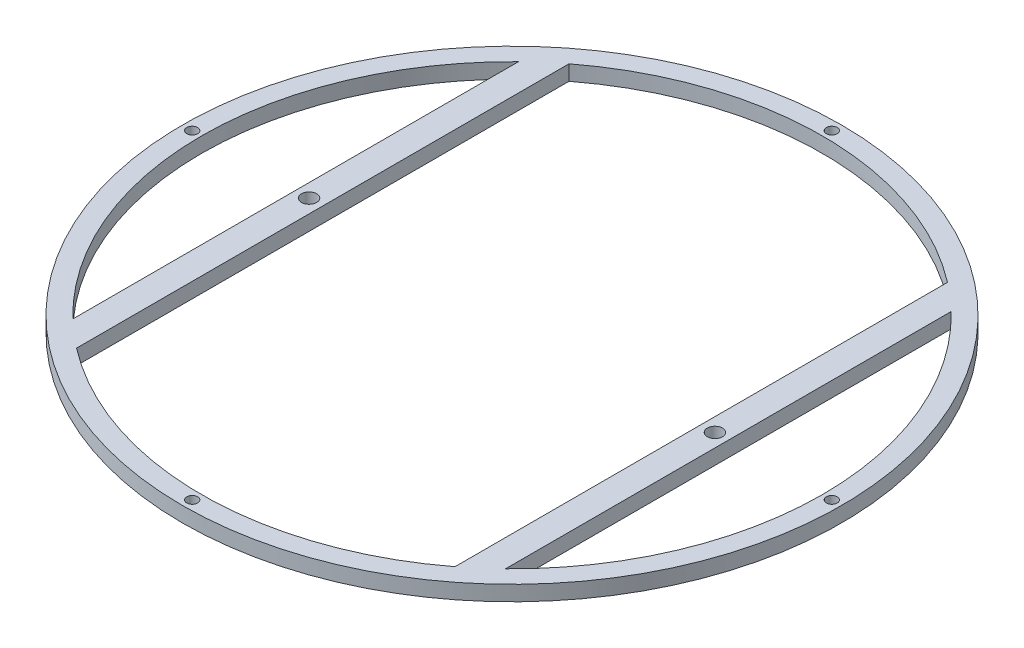
ISO-10303-21;
HEADER;
FILE_DESCRIPTION(('STEP AP214'),'2;1');
FILE_NAME('part.step','',(''),(''),'','','');
FILE_SCHEMA(('AUTOMOTIVE_DESIGN { 1 0 10303 214 1 1 1 1 }'));
ENDSEC;
DATA;
#1=APPLICATION_CONTEXT('core data for automotive mechanical design processes');
#2=APPLICATION_PROTOCOL_DEFINITION('international standard','automotive_design',2000,#1);
#3=PRODUCT_CONTEXT('',#1,'mechanical');
#4=PRODUCT('Part','Part','',(#3));
#5=PRODUCT_RELATED_PRODUCT_CATEGORY('part','',(#4));
#6=PRODUCT_DEFINITION_FORMATION('','',#4);
#7=PRODUCT_DEFINITION_CONTEXT('part definition',#1,'design');
#8=PRODUCT_DEFINITION('design','',#6,#7);
#9=PRODUCT_DEFINITION_SHAPE('','',#8);
#10=(LENGTH_UNIT() NAMED_UNIT(*) SI_UNIT(.MILLI.,.METRE.));
#11=(NAMED_UNIT(*) PLANE_ANGLE_UNIT() SI_UNIT($,.RADIAN.));
#12=(NAMED_UNIT(*) SI_UNIT($,.STERADIAN.) SOLID_ANGLE_UNIT());
#13=UNCERTAINTY_MEASURE_WITH_UNIT(LENGTH_MEASURE(1.E-05),#10,'distance_accuracy_value','');
#14=(GEOMETRIC_REPRESENTATION_CONTEXT(3) GLOBAL_UNCERTAINTY_ASSIGNED_CONTEXT((#13)) GLOBAL_UNIT_ASSIGNED_CONTEXT((#10,
#11,#12)) REPRESENTATION_CONTEXT('',''));
#15=CARTESIAN_POINT('',(0.,0.,0.));
#16=DIRECTION('',(0.,0.,1.));
#17=DIRECTION('',(1.,0.,0.));
#18=AXIS2_PLACEMENT_3D('',#15,#16,#17);
#19=CARTESIAN_POINT('',(0.,3.5,0.));
#20=DIRECTION('',(0.,-1.,0.));
#21=DIRECTION('',(0.,0.,-1.));
#22=AXIS2_PLACEMENT_3D('',#19,#20,#21);
#23=CYLINDRICAL_SURFACE('',#22,76.);
#24=CARTESIAN_POINT('',(0.,3.5,0.));
#25=DIRECTION('',(0.,1.,0.));
#26=DIRECTION('',(0.,0.,1.));
#27=AXIS2_PLACEMENT_3D('',#24,#25,#26);
#28=CIRCLE('',#27,76.);
#29=CARTESIAN_POINT('',(0.,3.5,76.));
#30=VERTEX_POINT('',#29);
#31=EDGE_CURVE('E11',#30,#30,#28,.T.);
#32=ORIENTED_EDGE('',*,*,#31,.F.);
#33=EDGE_LOOP('',(#32));
#34=FACE_BOUND('',#33,.T.);
#35=CARTESIAN_POINT('',(0.,0.,0.));
#36=DIRECTION('',(0.,1.,0.));
#37=DIRECTION('',(0.,0.,1.));
#38=AXIS2_PLACEMENT_3D('',#35,#36,#37);
#39=CIRCLE('',#38,76.);
#40=CARTESIAN_POINT('',(0.,0.,76.));
#41=VERTEX_POINT('',#40);
#42=EDGE_CURVE('E46',#41,#41,#39,.T.);
#43=ORIENTED_EDGE('',*,*,#42,.T.);
#44=EDGE_LOOP('',(#43));
#45=FACE_BOUND('',#44,.T.);
#46=ADVANCED_FACE('F43',(#34,#45),#23,.T.);
#47=CARTESIAN_POINT('',(0.,3.5,0.));
#48=DIRECTION('',(0.,1.,0.));
#49=DIRECTION('',(0.,0.,1.));
#50=AXIS2_PLACEMENT_3D('',#47,#48,#49);
#51=PLANE('',#50);
#52=CARTESIAN_POINT('',(0.,3.5,73.75));
#53=DIRECTION('',(0.,1.,0.));
#54=DIRECTION('',(0.,0.,1.));
#55=AXIS2_PLACEMENT_3D('',#52,#53,#54);
#56=CIRCLE('',#55,1.25);
#57=CARTESIAN_POINT('',(0.,3.5,75.));
#58=VERTEX_POINT('',#57);
#59=EDGE_CURVE('E291',#58,#58,#56,.T.);
#60=ORIENTED_EDGE('',*,*,#59,.F.);
#61=EDGE_LOOP('',(#60));
#62=FACE_BOUND('',#61,.T.);
#63=CARTESIAN_POINT('',(-73.75,3.5,0.));
#64=DIRECTION('',(0.,1.,0.));
#65=DIRECTION('',(0.,0.,1.));
#66=AXIS2_PLACEMENT_3D('',#63,#64,#65);
#67=CIRCLE('',#66,1.25);
#68=CARTESIAN_POINT('',(-73.75,3.5,1.25));
#69=VERTEX_POINT('',#68);
#70=EDGE_CURVE('E288',#69,#69,#67,.T.);
#71=ORIENTED_EDGE('',*,*,#70,.F.);
#72=EDGE_LOOP('',(#71));
#73=FACE_BOUND('',#72,.T.);
#74=CARTESIAN_POINT('',(73.75,3.5,0.));
#75=DIRECTION('',(0.,1.,0.));
#76=DIRECTION('',(0.,0.,-1.));
#77=AXIS2_PLACEMENT_3D('',#74,#75,#76);
#78=CIRCLE('',#77,1.25);
#79=CARTESIAN_POINT('',(73.75,3.5,-1.25));
#80=VERTEX_POINT('',#79);
#81=EDGE_CURVE('E282',#80,#80,#78,.T.);
#82=ORIENTED_EDGE('',*,*,#81,.F.);
#83=EDGE_LOOP('',(#82));
#84=FACE_BOUND('',#83,.T.);
#85=CARTESIAN_POINT('',(0.,3.5,-73.75));
#86=DIRECTION('',(0.,1.,0.));
#87=DIRECTION('',(0.,0.,-1.));
#88=AXIS2_PLACEMENT_3D('',#85,#86,#87);
#89=CIRCLE('',#88,1.25);
#90=CARTESIAN_POINT('',(0.,3.5,-75.));
#91=VERTEX_POINT('',#90);
#92=EDGE_CURVE('E276',#91,#91,#89,.T.);
#93=ORIENTED_EDGE('',*,*,#92,.F.);
#94=EDGE_LOOP('',(#93));
#95=FACE_BOUND('',#94,.T.);
#96=CARTESIAN_POINT('',(-46.7931691909373,3.5,0.));
#97=DIRECTION('',(0.,1.,0.));
#98=DIRECTION('',(0.,0.,1.));
#99=AXIS2_PLACEMENT_3D('',#96,#97,#98);
#100=CIRCLE('',#99,1.75);
#101=CARTESIAN_POINT('',(-46.7931691909373,3.5,1.75));
#102=VERTEX_POINT('',#101);
#103=EDGE_CURVE('E263',#102,#102,#100,.T.);
#104=ORIENTED_EDGE('',*,*,#103,.F.);
#105=EDGE_LOOP('',(#104));
#106=FACE_BOUND('',#105,.T.);
#107=CARTESIAN_POINT('',(46.7931691909373,3.5,0.));
#108=DIRECTION('',(0.,1.,0.));
#109=DIRECTION('',(0.,0.,-1.));
#110=AXIS2_PLACEMENT_3D('',#107,#108,#109);
#111=CIRCLE('',#110,1.75);
#112=CARTESIAN_POINT('',(46.7931691909373,3.5,-1.75));
#113=VERTEX_POINT('',#112);
#114=EDGE_CURVE('E261',#113,#113,#111,.T.);
#115=ORIENTED_EDGE('',*,*,#114,.F.);
#116=EDGE_LOOP('',(#115));
#117=FACE_BOUND('',#116,.T.);
#118=CARTESIAN_POINT('',(0.,3.5,0.));
#119=DIRECTION('',(0.,1.,0.));
#120=DIRECTION('',(0.,0.,1.));
#121=AXIS2_PLACEMENT_3D('',#118,#119,#120);
#122=CIRCLE('',#121,71.6206359691576);
#123=CARTESIAN_POINT('',(49.8931691909372,3.5,51.382751626505));
#124=VERTEX_POINT('',#123);
#125=CARTESIAN_POINT('',(49.8931691909372,3.5,-51.382751626505));
#126=VERTEX_POINT('',#125);
#127=EDGE_CURVE('E57',#124,#126,#122,.T.);
#128=ORIENTED_EDGE('',*,*,#127,.F.);
#129=DIRECTION('',(0.,0.,1.));
#130=VECTOR('',#129,1.);
#131=CARTESIAN_POINT('',(49.8931691909372,3.5,-51.382751626505));
#132=LINE('',#131,#130);
#133=EDGE_CURVE('E136',#126,#124,#132,.T.);
#134=ORIENTED_EDGE('',*,*,#133,.F.);
#135=EDGE_LOOP('',(#128,#134));
#136=FACE_BOUND('',#135,.T.);
#137=CARTESIAN_POINT('',(0.,3.5,0.));
#138=DIRECTION('',(0.,1.,0.));
#139=DIRECTION('',(0.,0.,1.));
#140=AXIS2_PLACEMENT_3D('',#137,#138,#139);
#141=CIRCLE('',#140,71.6206359691576);
#142=CARTESIAN_POINT('',(-49.8931691909373,3.5,-51.382751626505));
#143=VERTEX_POINT('',#142);
#144=CARTESIAN_POINT('',(-49.8931691909373,3.5,51.382751626505));
#145=VERTEX_POINT('',#144);
#146=EDGE_CURVE('E65',#143,#145,#141,.T.);
#147=ORIENTED_EDGE('',*,*,#146,.F.);
#148=DIRECTION('',(0.,0.,-1.));
#149=VECTOR('',#148,1.);
#150=CARTESIAN_POINT('',(-49.8931691909373,3.5,-51.382751626505));
#151=LINE('',#150,#149);
#152=EDGE_CURVE('E116',#145,#143,#151,.T.);
#153=ORIENTED_EDGE('',*,*,#152,.F.);
#154=EDGE_LOOP('',(#147,#153));
#155=FACE_BOUND('',#154,.T.);
#156=CARTESIAN_POINT('',(0.,3.5,0.));
#157=DIRECTION('',(0.,1.,0.));
#158=DIRECTION('',(0.,0.,1.));
#159=AXIS2_PLACEMENT_3D('',#156,#157,#158);
#160=CIRCLE('',#159,71.6206359691576);
#161=CARTESIAN_POINT('',(-43.6442747378757,3.5,56.7863784655389));
#162=VERTEX_POINT('',#161);
#163=CARTESIAN_POINT('',(43.6442747378757,3.5,56.7863784655389));
#164=VERTEX_POINT('',#163);
#165=EDGE_CURVE('E122',#162,#164,#160,.T.);
#166=ORIENTED_EDGE('',*,*,#165,.F.);
#167=DIRECTION('',(0.,0.,1.));
#168=VECTOR('',#167,1.);
#169=CARTESIAN_POINT('',(-43.6442747378757,3.5,-56.7863784655389));
#170=LINE('',#169,#168);
#171=CARTESIAN_POINT('',(-43.6442747378756,3.5,-56.7863784655389));
#172=VERTEX_POINT('',#171);
#173=EDGE_CURVE('E149',#172,#162,#170,.T.);
#174=ORIENTED_EDGE('',*,*,#173,.F.);
#175=CARTESIAN_POINT('',(0.,3.5,0.));
#176=DIRECTION('',(0.,1.,0.));
#177=DIRECTION('',(0.,0.,1.));
#178=AXIS2_PLACEMENT_3D('',#175,#176,#177);
#179=CIRCLE('',#178,71.6206359691576);
#180=CARTESIAN_POINT('',(43.6442747378757,3.5,-56.7863784655389));
#181=VERTEX_POINT('',#180);
#182=EDGE_CURVE('E161',#181,#172,#179,.T.);
#183=ORIENTED_EDGE('',*,*,#182,.F.);
#184=DIRECTION('',(0.,0.,-1.));
#185=VECTOR('',#184,1.);
#186=CARTESIAN_POINT('',(43.6442747378757,3.5,-56.7863784655389));
#187=LINE('',#186,#185);
#188=EDGE_CURVE('E124',#164,#181,#187,.T.);
#189=ORIENTED_EDGE('',*,*,#188,.F.);
#190=EDGE_LOOP('',(#166,#174,#183,#189));
#191=FACE_BOUND('',#190,.T.);
#192=ORIENTED_EDGE('',*,*,#31,.T.);
#193=EDGE_LOOP('',(#192));
#194=FACE_BOUND('',#193,.T.);
#195=ADVANCED_FACE('F120',(#62,#73,#84,#95,#106,#117,#136,#155,#191,#194),#51,.T.);
#196=CARTESIAN_POINT('',(0.,0.,0.));
#197=DIRECTION('',(0.,1.,0.));
#198=DIRECTION('',(0.,0.,1.));
#199=AXIS2_PLACEMENT_3D('',#196,#197,#198);
#200=PLANE('',#199);
#201=CARTESIAN_POINT('',(0.,0.,73.75));
#202=DIRECTION('',(0.,1.,0.));
#203=DIRECTION('',(0.,0.,1.));
#204=AXIS2_PLACEMENT_3D('',#201,#202,#203);
#205=CIRCLE('',#204,1.25);
#206=CARTESIAN_POINT('',(0.,0.,75.));
#207=VERTEX_POINT('',#206);
#208=EDGE_CURVE('E267',#207,#207,#205,.T.);
#209=ORIENTED_EDGE('',*,*,#208,.T.);
#210=EDGE_LOOP('',(#209));
#211=FACE_BOUND('',#210,.T.);
#212=CARTESIAN_POINT('',(-73.75,0.,0.));
#213=DIRECTION('',(0.,1.,0.));
#214=DIRECTION('',(0.,0.,1.));
#215=AXIS2_PLACEMENT_3D('',#212,#213,#214);
#216=CIRCLE('',#215,1.25);
#217=CARTESIAN_POINT('',(-73.75,0.,1.25));
#218=VERTEX_POINT('',#217);
#219=EDGE_CURVE('E285',#218,#218,#216,.T.);
#220=ORIENTED_EDGE('',*,*,#219,.T.);
#221=EDGE_LOOP('',(#220));
#222=FACE_BOUND('',#221,.T.);
#223=CARTESIAN_POINT('',(73.75,0.,0.));
#224=DIRECTION('',(0.,1.,0.));
#225=DIRECTION('',(0.,0.,-1.));
#226=AXIS2_PLACEMENT_3D('',#223,#224,#225);
#227=CIRCLE('',#226,1.25);
#228=CARTESIAN_POINT('',(73.75,0.,-1.25));
#229=VERTEX_POINT('',#228);
#230=EDGE_CURVE('E279',#229,#229,#227,.T.);
#231=ORIENTED_EDGE('',*,*,#230,.T.);
#232=EDGE_LOOP('',(#231));
#233=FACE_BOUND('',#232,.T.);
#234=CARTESIAN_POINT('',(0.,0.,-73.75));
#235=DIRECTION('',(0.,1.,0.));
#236=DIRECTION('',(0.,0.,-1.));
#237=AXIS2_PLACEMENT_3D('',#234,#235,#236);
#238=CIRCLE('',#237,1.25);
#239=CARTESIAN_POINT('',(0.,0.,-75.));
#240=VERTEX_POINT('',#239);
#241=EDGE_CURVE('E273',#240,#240,#238,.T.);
#242=ORIENTED_EDGE('',*,*,#241,.T.);
#243=EDGE_LOOP('',(#242));
#244=FACE_BOUND('',#243,.T.);
#245=CARTESIAN_POINT('',(-46.7931691909373,0.,0.));
#246=DIRECTION('',(0.,1.,0.));
#247=DIRECTION('',(0.,0.,1.));
#248=AXIS2_PLACEMENT_3D('',#245,#246,#247);
#249=CIRCLE('',#248,1.75);
#250=CARTESIAN_POINT('',(-46.7931691909373,0.,1.75));
#251=VERTEX_POINT('',#250);
#252=EDGE_CURVE('E135',#251,#251,#249,.T.);
#253=ORIENTED_EDGE('',*,*,#252,.T.);
#254=EDGE_LOOP('',(#253));
#255=FACE_BOUND('',#254,.T.);
#256=CARTESIAN_POINT('',(46.7931691909373,0.,0.));
#257=DIRECTION('',(0.,1.,0.));
#258=DIRECTION('',(0.,0.,-1.));
#259=AXIS2_PLACEMENT_3D('',#256,#257,#258);
#260=CIRCLE('',#259,1.75);
#261=CARTESIAN_POINT('',(46.7931691909373,0.,-1.75));
#262=VERTEX_POINT('',#261);
#263=EDGE_CURVE('E258',#262,#262,#260,.T.);
#264=ORIENTED_EDGE('',*,*,#263,.T.);
#265=EDGE_LOOP('',(#264));
#266=FACE_BOUND('',#265,.T.);
#267=DIRECTION('',(0.,0.,1.));
#268=VECTOR('',#267,1.);
#269=CARTESIAN_POINT('',(49.8931691909372,0.,-51.382751626505));
#270=LINE('',#269,#268);
#271=CARTESIAN_POINT('',(49.8931691909372,0.,-51.382751626505));
#272=VERTEX_POINT('',#271);
#273=CARTESIAN_POINT('',(49.8931691909372,0.,51.382751626505));
#274=VERTEX_POINT('',#273);
#275=EDGE_CURVE('E132',#272,#274,#270,.T.);
#276=ORIENTED_EDGE('',*,*,#275,.T.);
#277=CARTESIAN_POINT('',(0.,0.,0.));
#278=DIRECTION('',(0.,1.,0.));
#279=DIRECTION('',(0.,0.,1.));
#280=AXIS2_PLACEMENT_3D('',#277,#278,#279);
#281=CIRCLE('',#280,71.6206359691576);
#282=EDGE_CURVE('E139',#274,#272,#281,.T.);
#283=ORIENTED_EDGE('',*,*,#282,.T.);
#284=EDGE_LOOP('',(#276,#283));
#285=FACE_BOUND('',#284,.T.);
#286=DIRECTION('',(0.,0.,-1.));
#287=VECTOR('',#286,1.);
#288=CARTESIAN_POINT('',(-49.8931691909373,0.,-51.382751626505));
#289=LINE('',#288,#287);
#290=CARTESIAN_POINT('',(-49.8931691909373,0.,51.382751626505));
#291=VERTEX_POINT('',#290);
#292=CARTESIAN_POINT('',(-49.8931691909373,0.,-51.382751626505));
#293=VERTEX_POINT('',#292);
#294=EDGE_CURVE('E127',#291,#293,#289,.T.);
#295=ORIENTED_EDGE('',*,*,#294,.T.);
#296=CARTESIAN_POINT('',(0.,0.,0.));
#297=DIRECTION('',(0.,1.,0.));
#298=DIRECTION('',(0.,0.,1.));
#299=AXIS2_PLACEMENT_3D('',#296,#297,#298);
#300=CIRCLE('',#299,71.6206359691576);
#301=EDGE_CURVE('E109',#293,#291,#300,.T.);
#302=ORIENTED_EDGE('',*,*,#301,.T.);
#303=EDGE_LOOP('',(#295,#302));
#304=FACE_BOUND('',#303,.T.);
#305=DIRECTION('',(0.,0.,1.));
#306=VECTOR('',#305,1.);
#307=CARTESIAN_POINT('',(-43.6442747378757,0.,-56.7863784655389));
#308=LINE('',#307,#306);
#309=CARTESIAN_POINT('',(-43.6442747378756,0.,-56.7863784655389));
#310=VERTEX_POINT('',#309);
#311=CARTESIAN_POINT('',(-43.6442747378757,0.,56.7863784655389));
#312=VERTEX_POINT('',#311);
#313=EDGE_CURVE('E155',#310,#312,#308,.T.);
#314=ORIENTED_EDGE('',*,*,#313,.T.);
#315=CARTESIAN_POINT('',(0.,0.,0.));
#316=DIRECTION('',(0.,1.,0.));
#317=DIRECTION('',(0.,0.,1.));
#318=AXIS2_PLACEMENT_3D('',#315,#316,#317);
#319=CIRCLE('',#318,71.6206359691576);
#320=CARTESIAN_POINT('',(43.6442747378757,0.,56.7863784655389));
#321=VERTEX_POINT('',#320);
#322=EDGE_CURVE('E145',#312,#321,#319,.T.);
#323=ORIENTED_EDGE('',*,*,#322,.T.);
#324=DIRECTION('',(0.,0.,-1.));
#325=VECTOR('',#324,1.);
#326=CARTESIAN_POINT('',(43.6442747378757,0.,-56.7863784655389));
#327=LINE('',#326,#325);
#328=CARTESIAN_POINT('',(43.6442747378757,0.,-56.7863784655389));
#329=VERTEX_POINT('',#328);
#330=EDGE_CURVE('E148',#321,#329,#327,.T.);
#331=ORIENTED_EDGE('',*,*,#330,.T.);
#332=CARTESIAN_POINT('',(0.,0.,0.));
#333=DIRECTION('',(0.,1.,0.));
#334=DIRECTION('',(0.,0.,1.));
#335=AXIS2_PLACEMENT_3D('',#332,#333,#334);
#336=CIRCLE('',#335,71.6206359691576);
#337=EDGE_CURVE('E152',#329,#310,#336,.T.);
#338=ORIENTED_EDGE('',*,*,#337,.T.);
#339=EDGE_LOOP('',(#314,#323,#331,#338));
#340=FACE_BOUND('',#339,.T.);
#341=ORIENTED_EDGE('',*,*,#42,.F.);
#342=EDGE_LOOP('',(#341));
#343=FACE_BOUND('',#342,.T.);
#344=ADVANCED_FACE('F188',(#211,#222,#233,#244,#255,#266,#285,#304,#340,#343),#200,.F.);
#345=CARTESIAN_POINT('',(0.,0.,0.));
#346=DIRECTION('',(0.,1.,0.));
#347=DIRECTION('',(0.,0.,1.));
#348=AXIS2_PLACEMENT_3D('',#345,#346,#347);
#349=CYLINDRICAL_SURFACE('',#348,71.6206359691576);
#350=ORIENTED_EDGE('',*,*,#165,.T.);
#351=DIRECTION('',(0.,1.,0.));
#352=VECTOR('',#351,1.);
#353=CARTESIAN_POINT('',(43.6442747378757,0.,56.7863784655389));
#354=LINE('',#353,#352);
#355=EDGE_CURVE('E157',#321,#164,#354,.T.);
#356=ORIENTED_EDGE('',*,*,#355,.F.);
#357=ORIENTED_EDGE('',*,*,#322,.F.);
#358=DIRECTION('',(0.,1.,0.));
#359=VECTOR('',#358,1.);
#360=CARTESIAN_POINT('',(-43.6442747378757,0.,56.7863784655389));
#361=LINE('',#360,#359);
#362=EDGE_CURVE('E166',#312,#162,#361,.T.);
#363=ORIENTED_EDGE('',*,*,#362,.T.);
#364=EDGE_LOOP('',(#350,#356,#357,#363));
#365=FACE_BOUND('',#364,.T.);
#366=ADVANCED_FACE('F190',(#365),#349,.F.);
#367=CARTESIAN_POINT('',(-43.6442747378757,0.,-56.7863784655389));
#368=DIRECTION('',(-1.,0.,0.));
#369=DIRECTION('',(0.,0.,1.));
#370=AXIS2_PLACEMENT_3D('',#367,#368,#369);
#371=PLANE('',#370);
#372=ORIENTED_EDGE('',*,*,#173,.T.);
#373=ORIENTED_EDGE('',*,*,#362,.F.);
#374=ORIENTED_EDGE('',*,*,#313,.F.);
#375=DIRECTION('',(0.,1.,0.));
#376=VECTOR('',#375,1.);
#377=CARTESIAN_POINT('',(-43.6442747378756,0.,-56.7863784655389));
#378=LINE('',#377,#376);
#379=EDGE_CURVE('E168',#310,#172,#378,.T.);
#380=ORIENTED_EDGE('',*,*,#379,.T.);
#381=EDGE_LOOP('',(#372,#373,#374,#380));
#382=FACE_BOUND('',#381,.T.);
#383=ADVANCED_FACE('F192',(#382),#371,.F.);
#384=CARTESIAN_POINT('',(0.,0.,0.));
#385=DIRECTION('',(0.,1.,0.));
#386=DIRECTION('',(0.,0.,1.));
#387=AXIS2_PLACEMENT_3D('',#384,#385,#386);
#388=CYLINDRICAL_SURFACE('',#387,71.6206359691576);
#389=ORIENTED_EDGE('',*,*,#182,.T.);
#390=ORIENTED_EDGE('',*,*,#379,.F.);
#391=ORIENTED_EDGE('',*,*,#337,.F.);
#392=DIRECTION('',(0.,1.,0.));
#393=VECTOR('',#392,1.);
#394=CARTESIAN_POINT('',(43.6442747378757,0.,-56.7863784655389));
#395=LINE('',#394,#393);
#396=EDGE_CURVE('E170',#329,#181,#395,.T.);
#397=ORIENTED_EDGE('',*,*,#396,.T.);
#398=EDGE_LOOP('',(#389,#390,#391,#397));
#399=FACE_BOUND('',#398,.T.);
#400=ADVANCED_FACE('F185',(#399),#388,.F.);
#401=CARTESIAN_POINT('',(43.6442747378757,0.,-56.7863784655389));
#402=DIRECTION('',(1.,0.,0.));
#403=DIRECTION('',(0.,0.,-1.));
#404=AXIS2_PLACEMENT_3D('',#401,#402,#403);
#405=PLANE('',#404);
#406=ORIENTED_EDGE('',*,*,#188,.T.);
#407=ORIENTED_EDGE('',*,*,#396,.F.);
#408=ORIENTED_EDGE('',*,*,#330,.F.);
#409=ORIENTED_EDGE('',*,*,#355,.T.);
#410=EDGE_LOOP('',(#406,#407,#408,#409));
#411=FACE_BOUND('',#410,.T.);
#412=ADVANCED_FACE('F176',(#411),#405,.F.);
#413=CARTESIAN_POINT('',(0.,0.,0.));
#414=DIRECTION('',(0.,1.,0.));
#415=DIRECTION('',(0.,0.,1.));
#416=AXIS2_PLACEMENT_3D('',#413,#414,#415);
#417=CYLINDRICAL_SURFACE('',#416,71.6206359691576);
#418=ORIENTED_EDGE('',*,*,#146,.T.);
#419=DIRECTION('',(0.,1.,0.));
#420=VECTOR('',#419,1.);
#421=CARTESIAN_POINT('',(-49.8931691909373,0.,51.382751626505));
#422=LINE('',#421,#420);
#423=EDGE_CURVE('E113',#291,#145,#422,.T.);
#424=ORIENTED_EDGE('',*,*,#423,.F.);
#425=ORIENTED_EDGE('',*,*,#301,.F.);
#426=DIRECTION('',(0.,1.,0.));
#427=VECTOR('',#426,1.);
#428=CARTESIAN_POINT('',(-49.8931691909373,0.,-51.382751626505));
#429=LINE('',#428,#427);
#430=EDGE_CURVE('E105',#293,#143,#429,.T.);
#431=ORIENTED_EDGE('',*,*,#430,.T.);
#432=EDGE_LOOP('',(#418,#424,#425,#431));
#433=FACE_BOUND('',#432,.T.);
#434=ADVANCED_FACE('F107',(#433),#417,.F.);
#435=CARTESIAN_POINT('',(-49.8931691909373,0.,-51.382751626505));
#436=DIRECTION('',(1.,0.,0.));
#437=DIRECTION('',(0.,0.,-1.));
#438=AXIS2_PLACEMENT_3D('',#435,#436,#437);
#439=PLANE('',#438);
#440=ORIENTED_EDGE('',*,*,#152,.T.);
#441=ORIENTED_EDGE('',*,*,#430,.F.);
#442=ORIENTED_EDGE('',*,*,#294,.F.);
#443=ORIENTED_EDGE('',*,*,#423,.T.);
#444=EDGE_LOOP('',(#440,#441,#442,#443));
#445=FACE_BOUND('',#444,.T.);
#446=ADVANCED_FACE('F117',(#445),#439,.F.);
#447=CARTESIAN_POINT('',(0.,0.,0.));
#448=DIRECTION('',(0.,1.,0.));
#449=DIRECTION('',(0.,0.,1.));
#450=AXIS2_PLACEMENT_3D('',#447,#448,#449);
#451=CYLINDRICAL_SURFACE('',#450,71.6206359691576);
#452=ORIENTED_EDGE('',*,*,#127,.T.);
#453=DIRECTION('',(0.,1.,0.));
#454=VECTOR('',#453,1.);
#455=CARTESIAN_POINT('',(49.8931691909372,0.,-51.382751626505));
#456=LINE('',#455,#454);
#457=EDGE_CURVE('E130',#272,#126,#456,.T.);
#458=ORIENTED_EDGE('',*,*,#457,.F.);
#459=ORIENTED_EDGE('',*,*,#282,.F.);
#460=DIRECTION('',(0.,1.,0.));
#461=VECTOR('',#460,1.);
#462=CARTESIAN_POINT('',(49.8931691909372,0.,51.382751626505));
#463=LINE('',#462,#461);
#464=EDGE_CURVE('E133',#274,#124,#463,.T.);
#465=ORIENTED_EDGE('',*,*,#464,.T.);
#466=EDGE_LOOP('',(#452,#458,#459,#465));
#467=FACE_BOUND('',#466,.T.);
#468=ADVANCED_FACE('F229',(#467),#451,.F.);
#469=CARTESIAN_POINT('',(49.8931691909372,0.,-51.382751626505));
#470=DIRECTION('',(-1.,0.,0.));
#471=DIRECTION('',(0.,0.,1.));
#472=AXIS2_PLACEMENT_3D('',#469,#470,#471);
#473=PLANE('',#472);
#474=ORIENTED_EDGE('',*,*,#133,.T.);
#475=ORIENTED_EDGE('',*,*,#464,.F.);
#476=ORIENTED_EDGE('',*,*,#275,.F.);
#477=ORIENTED_EDGE('',*,*,#457,.T.);
#478=EDGE_LOOP('',(#474,#475,#476,#477));
#479=FACE_BOUND('',#478,.T.);
#480=ADVANCED_FACE('F236',(#479),#473,.F.);
#481=CARTESIAN_POINT('',(46.7931691909373,0.,0.));
#482=DIRECTION('',(0.,1.,0.));
#483=DIRECTION('',(0.,0.,1.));
#484=AXIS2_PLACEMENT_3D('',#481,#482,#483);
#485=CYLINDRICAL_SURFACE('',#484,1.75);
#486=ORIENTED_EDGE('',*,*,#263,.F.);
#487=EDGE_LOOP('',(#486));
#488=FACE_BOUND('',#487,.T.);
#489=ORIENTED_EDGE('',*,*,#114,.T.);
#490=EDGE_LOOP('',(#489));
#491=FACE_BOUND('',#490,.T.);
#492=ADVANCED_FACE('F232',(#488,#491),#485,.F.);
#493=CARTESIAN_POINT('',(-46.7931691909373,0.,0.));
#494=DIRECTION('',(0.,1.,0.));
#495=DIRECTION('',(0.,0.,1.));
#496=AXIS2_PLACEMENT_3D('',#493,#494,#495);
#497=CYLINDRICAL_SURFACE('',#496,1.75);
#498=ORIENTED_EDGE('',*,*,#252,.F.);
#499=EDGE_LOOP('',(#498));
#500=FACE_BOUND('',#499,.T.);
#501=ORIENTED_EDGE('',*,*,#103,.T.);
#502=EDGE_LOOP('',(#501));
#503=FACE_BOUND('',#502,.T.);
#504=ADVANCED_FACE('F242',(#500,#503),#497,.F.);
#505=CARTESIAN_POINT('',(0.,0.,-73.75));
#506=DIRECTION('',(0.,1.,0.));
#507=DIRECTION('',(0.,0.,1.));
#508=AXIS2_PLACEMENT_3D('',#505,#506,#507);
#509=CYLINDRICAL_SURFACE('',#508,1.25);
#510=ORIENTED_EDGE('',*,*,#241,.F.);
#511=EDGE_LOOP('',(#510));
#512=FACE_BOUND('',#511,.T.);
#513=ORIENTED_EDGE('',*,*,#92,.T.);
#514=EDGE_LOOP('',(#513));
#515=FACE_BOUND('',#514,.T.);
#516=ADVANCED_FACE('F253',(#512,#515),#509,.F.);
#517=CARTESIAN_POINT('',(73.75,0.,0.));
#518=DIRECTION('',(0.,1.,0.));
#519=DIRECTION('',(0.,0.,1.));
#520=AXIS2_PLACEMENT_3D('',#517,#518,#519);
#521=CYLINDRICAL_SURFACE('',#520,1.25);
#522=ORIENTED_EDGE('',*,*,#230,.F.);
#523=EDGE_LOOP('',(#522));
#524=FACE_BOUND('',#523,.T.);
#525=ORIENTED_EDGE('',*,*,#81,.T.);
#526=EDGE_LOOP('',(#525));
#527=FACE_BOUND('',#526,.T.);
#528=ADVANCED_FACE('F312',(#524,#527),#521,.F.);
#529=CARTESIAN_POINT('',(-73.75,0.,0.));
#530=DIRECTION('',(0.,1.,0.));
#531=DIRECTION('',(0.,0.,1.));
#532=AXIS2_PLACEMENT_3D('',#529,#530,#531);
#533=CYLINDRICAL_SURFACE('',#532,1.25);
#534=ORIENTED_EDGE('',*,*,#219,.F.);
#535=EDGE_LOOP('',(#534));
#536=FACE_BOUND('',#535,.T.);
#537=ORIENTED_EDGE('',*,*,#70,.T.);
#538=EDGE_LOOP('',(#537));
#539=FACE_BOUND('',#538,.T.);
#540=ADVANCED_FACE('F299',(#536,#539),#533,.F.);
#541=CARTESIAN_POINT('',(0.,0.,73.75));
#542=DIRECTION('',(0.,1.,0.));
#543=DIRECTION('',(0.,0.,1.));
#544=AXIS2_PLACEMENT_3D('',#541,#542,#543);
#545=CYLINDRICAL_SURFACE('',#544,1.25);
#546=ORIENTED_EDGE('',*,*,#208,.F.);
#547=EDGE_LOOP('',(#546));
#548=FACE_BOUND('',#547,.T.);
#549=ORIENTED_EDGE('',*,*,#59,.T.);
#550=EDGE_LOOP('',(#549));
#551=FACE_BOUND('',#550,.T.);
#552=ADVANCED_FACE('F296',(#548,#551),#545,.F.);
#553=CLOSED_SHELL('',(#46,#195,#344,#366,#383,#400,#412,#434,#446,#468,#480,#492,#504,#516,#528,
#540,#552));
#554=MANIFOLD_SOLID_BREP('B2',#553);
#555=ADVANCED_BREP_SHAPE_REPRESENTATION('',(#18,#554),#14);
#556=SHAPE_DEFINITION_REPRESENTATION(#9,#555);
ENDSEC;
END-ISO-10303-21;
